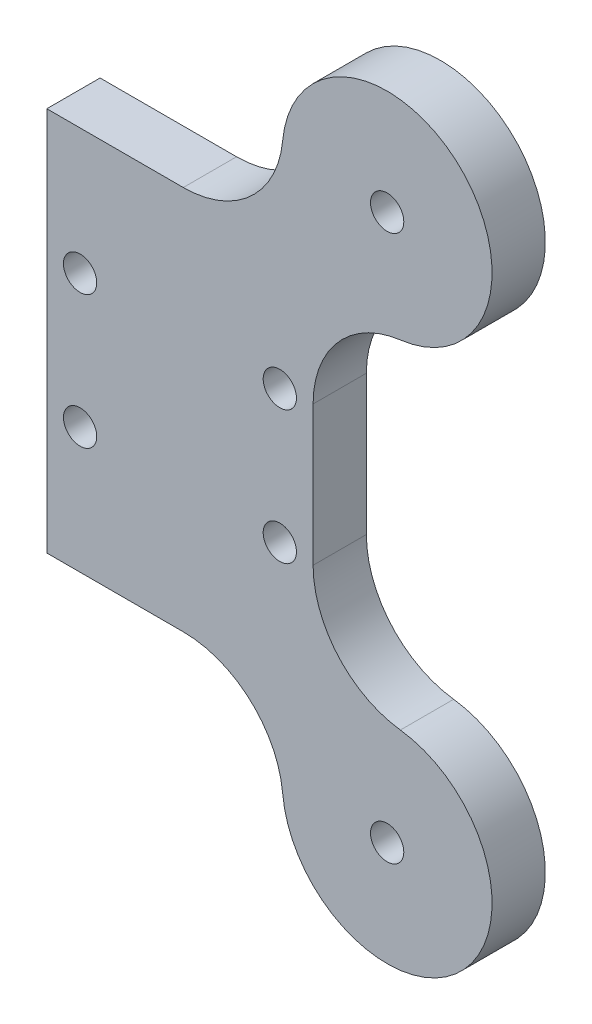
ISO-10303-21;
HEADER;
FILE_DESCRIPTION(('STEP AP214'),'2;1');
FILE_NAME('part.step','',(''),(''),'','','');
FILE_SCHEMA(('AUTOMOTIVE_DESIGN { 1 0 10303 214 1 1 1 1 }'));
ENDSEC;
DATA;
#1=APPLICATION_CONTEXT('core data for automotive mechanical design processes');
#2=APPLICATION_PROTOCOL_DEFINITION('international standard','automotive_design',2000,#1);
#3=PRODUCT_CONTEXT('',#1,'mechanical');
#4=PRODUCT('Part','Part','',(#3));
#5=PRODUCT_RELATED_PRODUCT_CATEGORY('part','',(#4));
#6=PRODUCT_DEFINITION_FORMATION('','',#4);
#7=PRODUCT_DEFINITION_CONTEXT('part definition',#1,'design');
#8=PRODUCT_DEFINITION('design','',#6,#7);
#9=PRODUCT_DEFINITION_SHAPE('','',#8);
#10=(LENGTH_UNIT() NAMED_UNIT(*) SI_UNIT(.MILLI.,.METRE.));
#11=(NAMED_UNIT(*) PLANE_ANGLE_UNIT() SI_UNIT($,.RADIAN.));
#12=(NAMED_UNIT(*) SI_UNIT($,.STERADIAN.) SOLID_ANGLE_UNIT());
#13=UNCERTAINTY_MEASURE_WITH_UNIT(LENGTH_MEASURE(1.E-05),#10,'distance_accuracy_value','');
#14=(GEOMETRIC_REPRESENTATION_CONTEXT(3) GLOBAL_UNCERTAINTY_ASSIGNED_CONTEXT((#13)) GLOBAL_UNIT_ASSIGNED_CONTEXT((#10,
#11,#12)) REPRESENTATION_CONTEXT('',''));
#15=CARTESIAN_POINT('',(0.,0.,0.));
#16=DIRECTION('',(0.,0.,1.));
#17=DIRECTION('',(1.,0.,0.));
#18=AXIS2_PLACEMENT_3D('',#15,#16,#17);
#19=CARTESIAN_POINT('',(15.5610000000004,-20.5022995801296,4.));
#20=DIRECTION('',(0.,0.,1.));
#21=DIRECTION('',(1.,0.,0.));
#22=AXIS2_PLACEMENT_3D('',#19,#20,#21);
#23=PLANE('',#22);
#24=CARTESIAN_POINT('',(15.5610000000004,-20.5022995801296,4.));
#25=DIRECTION('',(0.,0.,1.));
#26=DIRECTION('',(1.,0.,0.));
#27=AXIS2_PLACEMENT_3D('',#24,#25,#26);
#28=CIRCLE('',#27,1.25);
#29=CARTESIAN_POINT('',(16.8110000000004,-20.5022995801296,4.));
#30=VERTEX_POINT('',#29);
#31=EDGE_CURVE('E297',#30,#30,#28,.T.);
#32=ORIENTED_EDGE('',*,*,#31,.F.);
#33=EDGE_LOOP('',(#32));
#34=FACE_BOUND('',#33,.T.);
#35=DIRECTION('',(0.,-1.,0.));
#36=VECTOR('',#35,1.);
#37=CARTESIAN_POINT('',(9.99999999999999,0.,4.));
#38=LINE('',#37,#36);
#39=CARTESIAN_POINT('',(10.,5.24501676175074,4.));
#40=VERTEX_POINT('',#39);
#41=CARTESIAN_POINT('',(9.99999999999999,-5.24501676175066,4.));
#42=VERTEX_POINT('',#41);
#43=EDGE_CURVE('E309',#40,#42,#38,.T.);
#44=ORIENTED_EDGE('',*,*,#43,.F.);
#45=CARTESIAN_POINT('',(17.5,5.24501676175074,4.));
#46=DIRECTION('',(0.,0.,1.));
#47=DIRECTION('',(1.,0.,0.));
#48=AXIS2_PLACEMENT_3D('',#45,#46,#47);
#49=CIRCLE('',#48,7.5);
#50=CARTESIAN_POINT('',(16.554453836151,12.6851741829368,4.));
#51=VERTEX_POINT('',#50);
#52=EDGE_CURVE('E12',#40,#51,#49,.F.);
#53=ORIENTED_EDGE('',*,*,#52,.T.);
#54=CARTESIAN_POINT('',(15.5610000000003,20.5022995801297,4.));
#55=DIRECTION('',(0.,0.,-1.));
#56=DIRECTION('',(1.,0.,0.));
#57=AXIS2_PLACEMENT_3D('',#54,#55,#56);
#58=CIRCLE('',#57,7.88);
#59=CARTESIAN_POINT('',(7.715986955319,21.2440342555899,4.));
#60=VERTEX_POINT('',#59);
#61=EDGE_CURVE('E274',#60,#51,#58,.T.);
#62=ORIENTED_EDGE('',*,*,#61,.F.);
#63=CARTESIAN_POINT('',(0.249286722437037,21.95,4.));
#64=DIRECTION('',(0.,0.,1.));
#65=DIRECTION('',(1.,0.,0.));
#66=AXIS2_PLACEMENT_3D('',#63,#64,#65);
#67=CIRCLE('',#66,7.5);
#68=CARTESIAN_POINT('',(0.249286722437047,14.45,4.));
#69=VERTEX_POINT('',#68);
#70=EDGE_CURVE('E279',#60,#69,#67,.F.);
#71=ORIENTED_EDGE('',*,*,#70,.T.);
#72=DIRECTION('',(1.,0.,0.));
#73=VECTOR('',#72,1.);
#74=CARTESIAN_POINT('',(-10.0000000000001,14.45,4.));
#75=LINE('',#74,#73);
#76=CARTESIAN_POINT('',(-10.0000000000001,14.45,4.));
#77=VERTEX_POINT('',#76);
#78=EDGE_CURVE('E269',#77,#69,#75,.T.);
#79=ORIENTED_EDGE('',*,*,#78,.F.);
#80=DIRECTION('',(0.,-1.,0.));
#81=VECTOR('',#80,1.);
#82=CARTESIAN_POINT('',(-10.,0.,4.));
#83=LINE('',#82,#81);
#84=CARTESIAN_POINT('',(-10.,-14.45,4.));
#85=VERTEX_POINT('',#84);
#86=EDGE_CURVE('E252',#77,#85,#83,.T.);
#87=ORIENTED_EDGE('',*,*,#86,.T.);
#88=DIRECTION('',(1.,0.,0.));
#89=VECTOR('',#88,1.);
#90=CARTESIAN_POINT('',(-10.,-14.45,4.));
#91=LINE('',#90,#89);
#92=CARTESIAN_POINT('',(0.249286722437099,-14.45,4.));
#93=VERTEX_POINT('',#92);
#94=EDGE_CURVE('E263',#85,#93,#91,.T.);
#95=ORIENTED_EDGE('',*,*,#94,.T.);
#96=CARTESIAN_POINT('',(0.249286722437118,-21.95,4.));
#97=DIRECTION('',(0.,0.,1.));
#98=DIRECTION('',(1.,0.,0.));
#99=AXIS2_PLACEMENT_3D('',#96,#97,#98);
#100=CIRCLE('',#99,7.5);
#101=CARTESIAN_POINT('',(7.71598695531907,-21.2440342555898,4.));
#102=VERTEX_POINT('',#101);
#103=EDGE_CURVE('E337',#93,#102,#100,.F.);
#104=ORIENTED_EDGE('',*,*,#103,.T.);
#105=CARTESIAN_POINT('',(15.5610000000004,-20.5022995801296,4.));
#106=DIRECTION('',(0.,0.,1.));
#107=DIRECTION('',(1.,0.,0.));
#108=AXIS2_PLACEMENT_3D('',#105,#106,#107);
#109=CIRCLE('',#108,7.88);
#110=CARTESIAN_POINT('',(16.554453836151,-12.6851741829368,4.));
#111=VERTEX_POINT('',#110);
#112=EDGE_CURVE('E311',#102,#111,#109,.T.);
#113=ORIENTED_EDGE('',*,*,#112,.T.);
#114=CARTESIAN_POINT('',(17.5,-5.24501676175067,4.));
#115=DIRECTION('',(0.,0.,1.));
#116=DIRECTION('',(1.,0.,0.));
#117=AXIS2_PLACEMENT_3D('',#114,#115,#116);
#118=CIRCLE('',#117,7.5);
#119=EDGE_CURVE('E341',#111,#42,#118,.F.);
#120=ORIENTED_EDGE('',*,*,#119,.T.);
#121=EDGE_LOOP('',(#44,#53,#62,#71,#79,#87,#95,#104,#113,#120));
#122=FACE_BOUND('',#121,.T.);
#123=CARTESIAN_POINT('',(-7.49999999999997,-5.,4.));
#124=DIRECTION('',(0.,0.,1.));
#125=DIRECTION('',(1.,0.,0.));
#126=AXIS2_PLACEMENT_3D('',#123,#124,#125);
#127=CIRCLE('',#126,1.24999999999999);
#128=CARTESIAN_POINT('',(-6.24999999999998,-5.,4.));
#129=VERTEX_POINT('',#128);
#130=EDGE_CURVE('E303',#129,#129,#127,.T.);
#131=ORIENTED_EDGE('',*,*,#130,.F.);
#132=EDGE_LOOP('',(#131));
#133=FACE_BOUND('',#132,.T.);
#134=CARTESIAN_POINT('',(7.49999999999999,-5.,4.));
#135=DIRECTION('',(0.,0.,1.));
#136=DIRECTION('',(1.,0.,0.));
#137=AXIS2_PLACEMENT_3D('',#134,#135,#136);
#138=CIRCLE('',#137,1.24999999999999);
#139=CARTESIAN_POINT('',(8.74999999999998,-5.,4.));
#140=VERTEX_POINT('',#139);
#141=EDGE_CURVE('E291',#140,#140,#138,.T.);
#142=ORIENTED_EDGE('',*,*,#141,.F.);
#143=EDGE_LOOP('',(#142));
#144=FACE_BOUND('',#143,.T.);
#145=CARTESIAN_POINT('',(7.49999999999997,5.00000000000003,4.));
#146=DIRECTION('',(0.,0.,-1.));
#147=DIRECTION('',(1.,0.,0.));
#148=AXIS2_PLACEMENT_3D('',#145,#146,#147);
#149=CIRCLE('',#148,1.24999999999999);
#150=CARTESIAN_POINT('',(8.74999999999996,5.00000000000004,4.));
#151=VERTEX_POINT('',#150);
#152=EDGE_CURVE('E466',#151,#151,#149,.T.);
#153=ORIENTED_EDGE('',*,*,#152,.T.);
#154=EDGE_LOOP('',(#153));
#155=FACE_BOUND('',#154,.T.);
#156=CARTESIAN_POINT('',(15.5610000000003,20.5022995801297,4.));
#157=DIRECTION('',(0.,0.,-1.));
#158=DIRECTION('',(1.,0.,0.));
#159=AXIS2_PLACEMENT_3D('',#156,#157,#158);
#160=CIRCLE('',#159,1.25);
#161=CARTESIAN_POINT('',(16.8110000000003,20.5022995801297,4.));
#162=VERTEX_POINT('',#161);
#163=EDGE_CURVE('E460',#162,#162,#160,.T.);
#164=ORIENTED_EDGE('',*,*,#163,.T.);
#165=EDGE_LOOP('',(#164));
#166=FACE_BOUND('',#165,.T.);
#167=CARTESIAN_POINT('',(-7.49999999999999,4.99999999999998,4.));
#168=DIRECTION('',(0.,0.,-1.));
#169=DIRECTION('',(1.,0.,0.));
#170=AXIS2_PLACEMENT_3D('',#167,#168,#169);
#171=CIRCLE('',#170,1.24999999999999);
#172=CARTESIAN_POINT('',(-6.25,4.99999999999998,4.));
#173=VERTEX_POINT('',#172);
#174=EDGE_CURVE('E289',#173,#173,#171,.T.);
#175=ORIENTED_EDGE('',*,*,#174,.T.);
#176=EDGE_LOOP('',(#175));
#177=FACE_BOUND('',#176,.T.);
#178=ADVANCED_FACE('F177',(#34,#122,#133,#144,#155,#166,#177),#23,.T.);
#179=CARTESIAN_POINT('',(15.5610000000004,-20.5022995801296,0.));
#180=DIRECTION('',(0.,0.,1.));
#181=DIRECTION('',(1.,0.,0.));
#182=AXIS2_PLACEMENT_3D('',#179,#180,#181);
#183=PLANE('',#182);
#184=CARTESIAN_POINT('',(15.5610000000004,-20.5022995801296,0.));
#185=DIRECTION('',(0.,0.,1.));
#186=DIRECTION('',(1.,0.,0.));
#187=AXIS2_PLACEMENT_3D('',#184,#185,#186);
#188=CIRCLE('',#187,1.25);
#189=CARTESIAN_POINT('',(16.8110000000004,-20.5022995801296,0.));
#190=VERTEX_POINT('',#189);
#191=EDGE_CURVE('E294',#190,#190,#188,.T.);
#192=ORIENTED_EDGE('',*,*,#191,.T.);
#193=EDGE_LOOP('',(#192));
#194=FACE_BOUND('',#193,.T.);
#195=DIRECTION('',(0.,-1.,0.));
#196=VECTOR('',#195,1.);
#197=CARTESIAN_POINT('',(-10.,0.,0.));
#198=LINE('',#197,#196);
#199=CARTESIAN_POINT('',(-10.0000000000001,14.45,0.));
#200=VERTEX_POINT('',#199);
#201=CARTESIAN_POINT('',(-10.,-14.45,0.));
#202=VERTEX_POINT('',#201);
#203=EDGE_CURVE('E312',#200,#202,#198,.T.);
#204=ORIENTED_EDGE('',*,*,#203,.F.);
#205=DIRECTION('',(1.,0.,0.));
#206=VECTOR('',#205,1.);
#207=CARTESIAN_POINT('',(-10.0000000000001,14.45,0.));
#208=LINE('',#207,#206);
#209=CARTESIAN_POINT('',(0.249286722437047,14.45,0.));
#210=VERTEX_POINT('',#209);
#211=EDGE_CURVE('E272',#200,#210,#208,.T.);
#212=ORIENTED_EDGE('',*,*,#211,.T.);
#213=CARTESIAN_POINT('',(0.249286722437037,21.95,0.));
#214=DIRECTION('',(0.,0.,1.));
#215=DIRECTION('',(1.,0.,0.));
#216=AXIS2_PLACEMENT_3D('',#213,#214,#215);
#217=CIRCLE('',#216,7.5);
#218=CARTESIAN_POINT('',(7.715986955319,21.2440342555899,0.));
#219=VERTEX_POINT('',#218);
#220=EDGE_CURVE('E352',#210,#219,#217,.T.);
#221=ORIENTED_EDGE('',*,*,#220,.T.);
#222=CARTESIAN_POINT('',(15.5610000000003,20.5022995801297,0.));
#223=DIRECTION('',(0.,0.,-1.));
#224=DIRECTION('',(1.,0.,0.));
#225=AXIS2_PLACEMENT_3D('',#222,#223,#224);
#226=CIRCLE('',#225,7.88);
#227=CARTESIAN_POINT('',(16.554453836151,12.6851741829368,0.));
#228=VERTEX_POINT('',#227);
#229=EDGE_CURVE('E280',#219,#228,#226,.T.);
#230=ORIENTED_EDGE('',*,*,#229,.T.);
#231=CARTESIAN_POINT('',(17.5,5.24501676175074,0.));
#232=DIRECTION('',(0.,0.,1.));
#233=DIRECTION('',(1.,0.,0.));
#234=AXIS2_PLACEMENT_3D('',#231,#232,#233);
#235=CIRCLE('',#234,7.5);
#236=CARTESIAN_POINT('',(10.,5.24501676175074,0.));
#237=VERTEX_POINT('',#236);
#238=EDGE_CURVE('E185',#228,#237,#235,.T.);
#239=ORIENTED_EDGE('',*,*,#238,.T.);
#240=DIRECTION('',(0.,-1.,0.));
#241=VECTOR('',#240,1.);
#242=CARTESIAN_POINT('',(9.99999999999999,0.,0.));
#243=LINE('',#242,#241);
#244=CARTESIAN_POINT('',(9.99999999999999,-5.24501676175066,0.));
#245=VERTEX_POINT('',#244);
#246=EDGE_CURVE('E306',#237,#245,#243,.T.);
#247=ORIENTED_EDGE('',*,*,#246,.T.);
#248=CARTESIAN_POINT('',(17.5,-5.24501676175067,0.));
#249=DIRECTION('',(0.,0.,1.));
#250=DIRECTION('',(1.,0.,0.));
#251=AXIS2_PLACEMENT_3D('',#248,#249,#250);
#252=CIRCLE('',#251,7.5);
#253=CARTESIAN_POINT('',(16.554453836151,-12.6851741829368,0.));
#254=VERTEX_POINT('',#253);
#255=EDGE_CURVE('E339',#245,#254,#252,.T.);
#256=ORIENTED_EDGE('',*,*,#255,.T.);
#257=CARTESIAN_POINT('',(15.5610000000004,-20.5022995801296,0.));
#258=DIRECTION('',(0.,0.,1.));
#259=DIRECTION('',(1.,0.,0.));
#260=AXIS2_PLACEMENT_3D('',#257,#258,#259);
#261=CIRCLE('',#260,7.88);
#262=CARTESIAN_POINT('',(7.71598695531907,-21.2440342555898,0.));
#263=VERTEX_POINT('',#262);
#264=EDGE_CURVE('E317',#263,#254,#261,.T.);
#265=ORIENTED_EDGE('',*,*,#264,.F.);
#266=CARTESIAN_POINT('',(0.249286722437118,-21.95,0.));
#267=DIRECTION('',(0.,0.,1.));
#268=DIRECTION('',(1.,0.,0.));
#269=AXIS2_PLACEMENT_3D('',#266,#267,#268);
#270=CIRCLE('',#269,7.5);
#271=CARTESIAN_POINT('',(0.249286722437099,-14.45,0.));
#272=VERTEX_POINT('',#271);
#273=EDGE_CURVE('E335',#263,#272,#270,.T.);
#274=ORIENTED_EDGE('',*,*,#273,.T.);
#275=DIRECTION('',(1.,0.,0.));
#276=VECTOR('',#275,1.);
#277=CARTESIAN_POINT('',(-10.,-14.45,0.));
#278=LINE('',#277,#276);
#279=EDGE_CURVE('E320',#202,#272,#278,.T.);
#280=ORIENTED_EDGE('',*,*,#279,.F.);
#281=EDGE_LOOP('',(#204,#212,#221,#230,#239,#247,#256,#265,#274,#280));
#282=FACE_BOUND('',#281,.T.);
#283=CARTESIAN_POINT('',(-7.49999999999997,-5.,0.));
#284=DIRECTION('',(0.,0.,1.));
#285=DIRECTION('',(1.,0.,0.));
#286=AXIS2_PLACEMENT_3D('',#283,#284,#285);
#287=CIRCLE('',#286,1.24999999999999);
#288=CARTESIAN_POINT('',(-6.24999999999998,-5.,0.));
#289=VERTEX_POINT('',#288);
#290=EDGE_CURVE('E300',#289,#289,#287,.T.);
#291=ORIENTED_EDGE('',*,*,#290,.T.);
#292=EDGE_LOOP('',(#291));
#293=FACE_BOUND('',#292,.T.);
#294=CARTESIAN_POINT('',(7.49999999999999,-5.,0.));
#295=DIRECTION('',(0.,0.,1.));
#296=DIRECTION('',(1.,0.,0.));
#297=AXIS2_PLACEMENT_3D('',#294,#295,#296);
#298=CIRCLE('',#297,1.24999999999999);
#299=CARTESIAN_POINT('',(8.74999999999998,-5.,0.));
#300=VERTEX_POINT('',#299);
#301=EDGE_CURVE('E273',#300,#300,#298,.T.);
#302=ORIENTED_EDGE('',*,*,#301,.T.);
#303=EDGE_LOOP('',(#302));
#304=FACE_BOUND('',#303,.T.);
#305=CARTESIAN_POINT('',(7.49999999999997,5.00000000000003,0.));
#306=DIRECTION('',(0.,0.,-1.));
#307=DIRECTION('',(1.,0.,0.));
#308=AXIS2_PLACEMENT_3D('',#305,#306,#307);
#309=CIRCLE('',#308,1.24999999999999);
#310=CARTESIAN_POINT('',(8.74999999999996,5.00000000000004,0.));
#311=VERTEX_POINT('',#310);
#312=EDGE_CURVE('E452',#311,#311,#309,.T.);
#313=ORIENTED_EDGE('',*,*,#312,.F.);
#314=EDGE_LOOP('',(#313));
#315=FACE_BOUND('',#314,.T.);
#316=CARTESIAN_POINT('',(15.5610000000003,20.5022995801297,0.));
#317=DIRECTION('',(0.,0.,-1.));
#318=DIRECTION('',(1.,0.,0.));
#319=AXIS2_PLACEMENT_3D('',#316,#317,#318);
#320=CIRCLE('',#319,1.25);
#321=CARTESIAN_POINT('',(16.8110000000003,20.5022995801297,0.));
#322=VERTEX_POINT('',#321);
#323=EDGE_CURVE('E456',#322,#322,#320,.T.);
#324=ORIENTED_EDGE('',*,*,#323,.F.);
#325=EDGE_LOOP('',(#324));
#326=FACE_BOUND('',#325,.T.);
#327=CARTESIAN_POINT('',(-7.49999999999999,4.99999999999998,0.));
#328=DIRECTION('',(0.,0.,-1.));
#329=DIRECTION('',(1.,0.,0.));
#330=AXIS2_PLACEMENT_3D('',#327,#328,#329);
#331=CIRCLE('',#330,1.24999999999999);
#332=CARTESIAN_POINT('',(-6.25,4.99999999999998,0.));
#333=VERTEX_POINT('',#332);
#334=EDGE_CURVE('E286',#333,#333,#331,.T.);
#335=ORIENTED_EDGE('',*,*,#334,.F.);
#336=EDGE_LOOP('',(#335));
#337=FACE_BOUND('',#336,.T.);
#338=ADVANCED_FACE('F355',(#194,#282,#293,#304,#315,#326,#337),#183,.F.);
#339=CARTESIAN_POINT('',(-10.,0.,4.));
#340=DIRECTION('',(1.,0.,0.));
#341=DIRECTION('',(0.,1.,0.));
#342=AXIS2_PLACEMENT_3D('',#339,#340,#341);
#343=PLANE('',#342);
#344=ORIENTED_EDGE('',*,*,#203,.T.);
#345=DIRECTION('',(0.,0.,-1.));
#346=VECTOR('',#345,1.);
#347=CARTESIAN_POINT('',(-10.,-14.45,4.));
#348=LINE('',#347,#346);
#349=EDGE_CURVE('E258',#85,#202,#348,.T.);
#350=ORIENTED_EDGE('',*,*,#349,.F.);
#351=ORIENTED_EDGE('',*,*,#86,.F.);
#352=DIRECTION('',(0.,0.,-1.));
#353=VECTOR('',#352,1.);
#354=CARTESIAN_POINT('',(-10.0000000000001,14.45,4.));
#355=LINE('',#354,#353);
#356=EDGE_CURVE('E255',#77,#200,#355,.T.);
#357=ORIENTED_EDGE('',*,*,#356,.T.);
#358=EDGE_LOOP('',(#344,#350,#351,#357));
#359=FACE_BOUND('',#358,.T.);
#360=ADVANCED_FACE('F254',(#359),#343,.F.);
#361=CARTESIAN_POINT('',(-10.,-14.45,4.));
#362=DIRECTION('',(0.,1.,0.));
#363=DIRECTION('',(-1.,0.,0.));
#364=AXIS2_PLACEMENT_3D('',#361,#362,#363);
#365=PLANE('',#364);
#366=ORIENTED_EDGE('',*,*,#279,.T.);
#367=DIRECTION('',(0.,0.,1.));
#368=VECTOR('',#367,1.);
#369=CARTESIAN_POINT('',(0.2492867224371,-14.45,4.));
#370=LINE('',#369,#368);
#371=EDGE_CURVE('E330',#272,#93,#370,.T.);
#372=ORIENTED_EDGE('',*,*,#371,.T.);
#373=ORIENTED_EDGE('',*,*,#94,.F.);
#374=ORIENTED_EDGE('',*,*,#349,.T.);
#375=EDGE_LOOP('',(#366,#372,#373,#374));
#376=FACE_BOUND('',#375,.T.);
#377=ADVANCED_FACE('F389',(#376),#365,.F.);
#378=CARTESIAN_POINT('',(15.5610000000004,-20.5022995801296,4.));
#379=DIRECTION('',(0.,0.,-1.));
#380=DIRECTION('',(-1.,0.,0.));
#381=AXIS2_PLACEMENT_3D('',#378,#379,#380);
#382=CYLINDRICAL_SURFACE('',#381,7.88);
#383=ORIENTED_EDGE('',*,*,#112,.F.);
#384=DIRECTION('',(0.,0.,-1.));
#385=VECTOR('',#384,1.);
#386=CARTESIAN_POINT('',(7.71598695531907,-21.2440342555898,4.));
#387=LINE('',#386,#385);
#388=EDGE_CURVE('E327',#102,#263,#387,.T.);
#389=ORIENTED_EDGE('',*,*,#388,.T.);
#390=ORIENTED_EDGE('',*,*,#264,.T.);
#391=DIRECTION('',(0.,0.,-1.));
#392=VECTOR('',#391,1.);
#393=CARTESIAN_POINT('',(16.554453836151,-12.6851741829368,4.));
#394=LINE('',#393,#392);
#395=EDGE_CURVE('E325',#254,#111,#394,.F.);
#396=ORIENTED_EDGE('',*,*,#395,.T.);
#397=EDGE_LOOP('',(#383,#389,#390,#396));
#398=FACE_BOUND('',#397,.T.);
#399=ADVANCED_FACE('F392',(#398),#382,.T.);
#400=CARTESIAN_POINT('',(9.99999999999999,0.,4.));
#401=DIRECTION('',(1.,0.,0.));
#402=DIRECTION('',(0.,1.,0.));
#403=AXIS2_PLACEMENT_3D('',#400,#401,#402);
#404=PLANE('',#403);
#405=ORIENTED_EDGE('',*,*,#246,.F.);
#406=DIRECTION('',(0.,0.,1.));
#407=VECTOR('',#406,1.);
#408=CARTESIAN_POINT('',(10.,5.24501676175074,4.));
#409=LINE('',#408,#407);
#410=EDGE_CURVE('E198',#237,#40,#409,.T.);
#411=ORIENTED_EDGE('',*,*,#410,.T.);
#412=ORIENTED_EDGE('',*,*,#43,.T.);
#413=DIRECTION('',(0.,0.,-1.));
#414=VECTOR('',#413,1.);
#415=CARTESIAN_POINT('',(9.99999999999999,-5.24501676175066,4.));
#416=LINE('',#415,#414);
#417=EDGE_CURVE('E332',#42,#245,#416,.T.);
#418=ORIENTED_EDGE('',*,*,#417,.T.);
#419=EDGE_LOOP('',(#405,#411,#412,#418));
#420=FACE_BOUND('',#419,.T.);
#421=ADVANCED_FACE('F396',(#420),#404,.T.);
#422=CARTESIAN_POINT('',(-7.49999999999997,-5.,4.));
#423=DIRECTION('',(0.,0.,-1.));
#424=DIRECTION('',(-1.,0.,0.));
#425=AXIS2_PLACEMENT_3D('',#422,#423,#424);
#426=CYLINDRICAL_SURFACE('',#425,1.24999999999999);
#427=ORIENTED_EDGE('',*,*,#130,.T.);
#428=EDGE_LOOP('',(#427));
#429=FACE_BOUND('',#428,.T.);
#430=ORIENTED_EDGE('',*,*,#290,.F.);
#431=EDGE_LOOP('',(#430));
#432=FACE_BOUND('',#431,.T.);
#433=ADVANCED_FACE('F384',(#429,#432),#426,.F.);
#434=CARTESIAN_POINT('',(15.5610000000004,-20.5022995801296,4.));
#435=DIRECTION('',(0.,0.,-1.));
#436=DIRECTION('',(-1.,0.,0.));
#437=AXIS2_PLACEMENT_3D('',#434,#435,#436);
#438=CYLINDRICAL_SURFACE('',#437,1.25);
#439=ORIENTED_EDGE('',*,*,#31,.T.);
#440=EDGE_LOOP('',(#439));
#441=FACE_BOUND('',#440,.T.);
#442=ORIENTED_EDGE('',*,*,#191,.F.);
#443=EDGE_LOOP('',(#442));
#444=FACE_BOUND('',#443,.T.);
#445=ADVANCED_FACE('F431',(#441,#444),#438,.F.);
#446=CARTESIAN_POINT('',(7.49999999999999,-5.,4.));
#447=DIRECTION('',(0.,0.,-1.));
#448=DIRECTION('',(-1.,0.,0.));
#449=AXIS2_PLACEMENT_3D('',#446,#447,#448);
#450=CYLINDRICAL_SURFACE('',#449,1.24999999999999);
#451=ORIENTED_EDGE('',*,*,#141,.T.);
#452=EDGE_LOOP('',(#451));
#453=FACE_BOUND('',#452,.T.);
#454=ORIENTED_EDGE('',*,*,#301,.F.);
#455=EDGE_LOOP('',(#454));
#456=FACE_BOUND('',#455,.T.);
#457=ADVANCED_FACE('F403',(#453,#456),#450,.F.);
#458=CARTESIAN_POINT('',(0.249286722437118,-21.95,4.));
#459=DIRECTION('',(0.,0.,-1.));
#460=DIRECTION('',(-1.,0.,0.));
#461=AXIS2_PLACEMENT_3D('',#458,#459,#460);
#462=CYLINDRICAL_SURFACE('',#461,7.5);
#463=ORIENTED_EDGE('',*,*,#103,.F.);
#464=ORIENTED_EDGE('',*,*,#371,.F.);
#465=ORIENTED_EDGE('',*,*,#273,.F.);
#466=ORIENTED_EDGE('',*,*,#388,.F.);
#467=EDGE_LOOP('',(#463,#464,#465,#466));
#468=FACE_BOUND('',#467,.T.);
#469=ADVANCED_FACE('F400',(#468),#462,.F.);
#470=CARTESIAN_POINT('',(17.5,-5.24501676175067,4.));
#471=DIRECTION('',(0.,0.,-1.));
#472=DIRECTION('',(-1.,0.,0.));
#473=AXIS2_PLACEMENT_3D('',#470,#471,#472);
#474=CYLINDRICAL_SURFACE('',#473,7.5);
#475=ORIENTED_EDGE('',*,*,#119,.F.);
#476=ORIENTED_EDGE('',*,*,#395,.F.);
#477=ORIENTED_EDGE('',*,*,#255,.F.);
#478=ORIENTED_EDGE('',*,*,#417,.F.);
#479=EDGE_LOOP('',(#475,#476,#477,#478));
#480=FACE_BOUND('',#479,.T.);
#481=ADVANCED_FACE('F402',(#480),#474,.F.);
#482=CARTESIAN_POINT('',(15.5610000000003,20.5022995801297,4.));
#483=DIRECTION('',(0.,0.,-1.));
#484=DIRECTION('',(-1.,0.,0.));
#485=AXIS2_PLACEMENT_3D('',#482,#483,#484);
#486=CYLINDRICAL_SURFACE('',#485,7.88);
#487=ORIENTED_EDGE('',*,*,#229,.F.);
#488=DIRECTION('',(0.,0.,-1.));
#489=VECTOR('',#488,1.);
#490=CARTESIAN_POINT('',(7.71598695531899,21.2440342555899,4.));
#491=LINE('',#490,#489);
#492=EDGE_CURVE('E349',#219,#60,#491,.F.);
#493=ORIENTED_EDGE('',*,*,#492,.T.);
#494=ORIENTED_EDGE('',*,*,#61,.T.);
#495=DIRECTION('',(0.,0.,-1.));
#496=VECTOR('',#495,1.);
#497=CARTESIAN_POINT('',(16.554453836151,12.6851741829368,4.));
#498=LINE('',#497,#496);
#499=EDGE_CURVE('E346',#51,#228,#498,.T.);
#500=ORIENTED_EDGE('',*,*,#499,.T.);
#501=EDGE_LOOP('',(#487,#493,#494,#500));
#502=FACE_BOUND('',#501,.T.);
#503=ADVANCED_FACE('F360',(#502),#486,.T.);
#504=CARTESIAN_POINT('',(-10.0000000000001,14.45,4.));
#505=DIRECTION('',(0.,1.,0.));
#506=DIRECTION('',(-1.,0.,0.));
#507=AXIS2_PLACEMENT_3D('',#504,#505,#506);
#508=PLANE('',#507);
#509=ORIENTED_EDGE('',*,*,#78,.T.);
#510=DIRECTION('',(0.,0.,1.));
#511=VECTOR('',#510,1.);
#512=CARTESIAN_POINT('',(0.249286722437047,14.45,0.));
#513=LINE('',#512,#511);
#514=EDGE_CURVE('E344',#69,#210,#513,.F.);
#515=ORIENTED_EDGE('',*,*,#514,.T.);
#516=ORIENTED_EDGE('',*,*,#211,.F.);
#517=ORIENTED_EDGE('',*,*,#356,.F.);
#518=EDGE_LOOP('',(#509,#515,#516,#517));
#519=FACE_BOUND('',#518,.T.);
#520=ADVANCED_FACE('F267',(#519),#508,.T.);
#521=CARTESIAN_POINT('',(-7.49999999999999,4.99999999999998,4.));
#522=DIRECTION('',(0.,0.,-1.));
#523=DIRECTION('',(-1.,0.,0.));
#524=AXIS2_PLACEMENT_3D('',#521,#522,#523);
#525=CYLINDRICAL_SURFACE('',#524,1.24999999999999);
#526=ORIENTED_EDGE('',*,*,#174,.F.);
#527=EDGE_LOOP('',(#526));
#528=FACE_BOUND('',#527,.T.);
#529=ORIENTED_EDGE('',*,*,#334,.T.);
#530=EDGE_LOOP('',(#529));
#531=FACE_BOUND('',#530,.T.);
#532=ADVANCED_FACE('F425',(#528,#531),#525,.F.);
#533=CARTESIAN_POINT('',(15.5610000000003,20.5022995801297,4.));
#534=DIRECTION('',(0.,0.,-1.));
#535=DIRECTION('',(-1.,0.,0.));
#536=AXIS2_PLACEMENT_3D('',#533,#534,#535);
#537=CYLINDRICAL_SURFACE('',#536,1.25);
#538=ORIENTED_EDGE('',*,*,#163,.F.);
#539=EDGE_LOOP('',(#538));
#540=FACE_BOUND('',#539,.T.);
#541=ORIENTED_EDGE('',*,*,#323,.T.);
#542=EDGE_LOOP('',(#541));
#543=FACE_BOUND('',#542,.T.);
#544=ADVANCED_FACE('F370',(#540,#543),#537,.F.);
#545=CARTESIAN_POINT('',(7.49999999999997,5.00000000000003,4.));
#546=DIRECTION('',(0.,0.,-1.));
#547=DIRECTION('',(-1.,0.,0.));
#548=AXIS2_PLACEMENT_3D('',#545,#546,#547);
#549=CYLINDRICAL_SURFACE('',#548,1.24999999999999);
#550=ORIENTED_EDGE('',*,*,#152,.F.);
#551=EDGE_LOOP('',(#550));
#552=FACE_BOUND('',#551,.T.);
#553=ORIENTED_EDGE('',*,*,#312,.T.);
#554=EDGE_LOOP('',(#553));
#555=FACE_BOUND('',#554,.T.);
#556=ADVANCED_FACE('F364',(#552,#555),#549,.F.);
#557=CARTESIAN_POINT('',(0.249286722437037,21.95,4.));
#558=DIRECTION('',(0.,0.,-1.));
#559=DIRECTION('',(-1.,0.,0.));
#560=AXIS2_PLACEMENT_3D('',#557,#558,#559);
#561=CYLINDRICAL_SURFACE('',#560,7.5);
#562=ORIENTED_EDGE('',*,*,#70,.F.);
#563=ORIENTED_EDGE('',*,*,#492,.F.);
#564=ORIENTED_EDGE('',*,*,#220,.F.);
#565=ORIENTED_EDGE('',*,*,#514,.F.);
#566=EDGE_LOOP('',(#562,#563,#564,#565));
#567=FACE_BOUND('',#566,.T.);
#568=ADVANCED_FACE('F362',(#567),#561,.F.);
#569=CARTESIAN_POINT('',(17.5,5.24501676175074,4.));
#570=DIRECTION('',(0.,0.,-1.));
#571=DIRECTION('',(-1.,0.,0.));
#572=AXIS2_PLACEMENT_3D('',#569,#570,#571);
#573=CYLINDRICAL_SURFACE('',#572,7.5);
#574=ORIENTED_EDGE('',*,*,#52,.F.);
#575=ORIENTED_EDGE('',*,*,#410,.F.);
#576=ORIENTED_EDGE('',*,*,#238,.F.);
#577=ORIENTED_EDGE('',*,*,#499,.F.);
#578=EDGE_LOOP('',(#574,#575,#576,#577));
#579=FACE_BOUND('',#578,.T.);
#580=ADVANCED_FACE('F179',(#579),#573,.F.);
#581=CLOSED_SHELL('',(#178,#338,#360,#377,#399,#421,#433,#445,#457,#469,#481,#503,#520,#532,
#544,#556,#568,#580));
#582=MANIFOLD_SOLID_BREP('B2',#581);
#583=ADVANCED_BREP_SHAPE_REPRESENTATION('',(#18,#582),#14);
#584=SHAPE_DEFINITION_REPRESENTATION(#9,#583);
ENDSEC;
END-ISO-10303-21;
